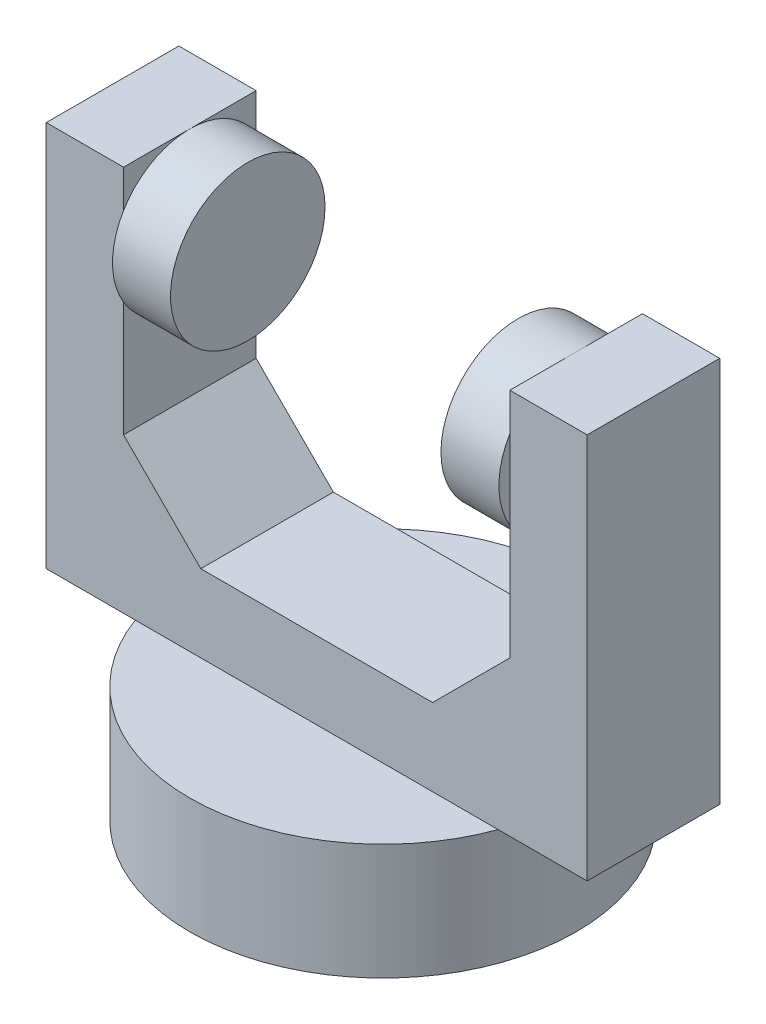
ISO-10303-21;
HEADER;
FILE_DESCRIPTION(('STEP AP214'),'2;1');
FILE_NAME('part.step','',(''),(''),'','','');
FILE_SCHEMA(('AUTOMOTIVE_DESIGN { 1 0 10303 214 1 1 1 1 }'));
ENDSEC;
DATA;
#1=APPLICATION_CONTEXT('core data for automotive mechanical design processes');
#2=APPLICATION_PROTOCOL_DEFINITION('international standard','automotive_design',2000,#1);
#3=PRODUCT_CONTEXT('',#1,'mechanical');
#4=PRODUCT('Part','Part','',(#3));
#5=PRODUCT_RELATED_PRODUCT_CATEGORY('part','',(#4));
#6=PRODUCT_DEFINITION_FORMATION('','',#4);
#7=PRODUCT_DEFINITION_CONTEXT('part definition',#1,'design');
#8=PRODUCT_DEFINITION('design','',#6,#7);
#9=PRODUCT_DEFINITION_SHAPE('','',#8);
#10=(LENGTH_UNIT() NAMED_UNIT(*) SI_UNIT(.MILLI.,.METRE.));
#11=(NAMED_UNIT(*) PLANE_ANGLE_UNIT() SI_UNIT($,.RADIAN.));
#12=(NAMED_UNIT(*) SI_UNIT($,.STERADIAN.) SOLID_ANGLE_UNIT());
#13=UNCERTAINTY_MEASURE_WITH_UNIT(LENGTH_MEASURE(1.E-05),#10,'distance_accuracy_value','');
#14=(GEOMETRIC_REPRESENTATION_CONTEXT(3) GLOBAL_UNCERTAINTY_ASSIGNED_CONTEXT((#13)) GLOBAL_UNIT_ASSIGNED_CONTEXT((#10,
#11,#12)) REPRESENTATION_CONTEXT('',''));
#15=CARTESIAN_POINT('',(0.,0.,0.));
#16=DIRECTION('',(0.,0.,1.));
#17=DIRECTION('',(1.,0.,0.));
#18=AXIS2_PLACEMENT_3D('',#15,#16,#17);
#19=CARTESIAN_POINT('',(12.5,12.5,-4.29038395748194));
#20=DIRECTION('',(1.,0.,0.));
#21=DIRECTION('',(0.,0.,-1.));
#22=AXIS2_PLACEMENT_3D('',#19,#20,#21);
#23=PLANE('',#22);
#24=DIRECTION('',(0.,1.,0.));
#25=VECTOR('',#24,1.);
#26=CARTESIAN_POINT('',(12.5,12.5,-4.29038395748194));
#27=LINE('',#26,#25);
#28=CARTESIAN_POINT('',(12.5,17.5,-4.29038395748194));
#29=VERTEX_POINT('',#28);
#30=CARTESIAN_POINT('',(12.5,24.9323930407125,-4.29038395748194));
#31=VERTEX_POINT('',#30);
#32=EDGE_CURVE('E162',#29,#31,#27,.T.);
#33=ORIENTED_EDGE('',*,*,#32,.F.);
#34=DIRECTION('',(0.,0.,1.));
#35=VECTOR('',#34,1.);
#36=CARTESIAN_POINT('',(12.5,17.5,-4.29038395748194));
#37=LINE('',#36,#35);
#38=CARTESIAN_POINT('',(12.5,17.5,4.29038395748193));
#39=VERTEX_POINT('',#38);
#40=EDGE_CURVE('E55',#29,#39,#37,.T.);
#41=ORIENTED_EDGE('',*,*,#40,.T.);
#42=DIRECTION('',(0.,1.,0.));
#43=VECTOR('',#42,1.);
#44=CARTESIAN_POINT('',(12.5,12.5,4.29038395748193));
#45=LINE('',#44,#43);
#46=CARTESIAN_POINT('',(12.5,24.9323930407125,4.29038395748193));
#47=VERTEX_POINT('',#46);
#48=EDGE_CURVE('E177',#39,#47,#45,.T.);
#49=ORIENTED_EDGE('',*,*,#48,.T.);
#50=CARTESIAN_POINT('',(12.5,27.5,0.));
#51=DIRECTION('',(1.,0.,0.));
#52=DIRECTION('',(0.,0.,-1.));
#53=AXIS2_PLACEMENT_3D('',#50,#51,#52);
#54=CIRCLE('',#53,5.);
#55=EDGE_CURVE('E190',#31,#47,#54,.F.);
#56=ORIENTED_EDGE('',*,*,#55,.F.);
#57=EDGE_LOOP('',(#33,#41,#49,#56));
#58=FACE_BOUND('',#57,.T.);
#59=ADVANCED_FACE('F39',(#58),#23,.F.);
#60=CARTESIAN_POINT('',(12.5,27.5,0.));
#61=DIRECTION('',(-1.,0.,0.));
#62=DIRECTION('',(0.,0.,1.));
#63=AXIS2_PLACEMENT_3D('',#60,#61,#62);
#64=CIRCLE('',#63,5.);
#65=CARTESIAN_POINT('',(12.5,30.0676069592875,4.29038395748193));
#66=VERTEX_POINT('',#65);
#67=CARTESIAN_POINT('',(12.5,32.5,0.));
#68=VERTEX_POINT('',#67);
#69=EDGE_CURVE('E183',#66,#68,#64,.T.);
#70=ORIENTED_EDGE('',*,*,#69,.F.);
#71=CARTESIAN_POINT('',(12.5,32.5,4.29038395748194));
#72=VERTEX_POINT('',#71);
#73=EDGE_CURVE('E261',#66,#72,#45,.T.);
#74=ORIENTED_EDGE('',*,*,#73,.T.);
#75=DIRECTION('',(0.,0.,-1.));
#76=VECTOR('',#75,1.);
#77=CARTESIAN_POINT('',(12.5,32.5,-4.29038395748194));
#78=LINE('',#77,#76);
#79=EDGE_CURVE('E240',#72,#68,#78,.T.);
#80=ORIENTED_EDGE('',*,*,#79,.T.);
#81=EDGE_LOOP('',(#70,#74,#80));
#82=FACE_BOUND('',#81,.T.);
#83=ADVANCED_FACE('F376',(#82),#23,.F.);
#84=CARTESIAN_POINT('',(-12.5,12.5,-4.29038395748194));
#85=DIRECTION('',(-1.,0.,0.));
#86=DIRECTION('',(0.,0.,1.));
#87=AXIS2_PLACEMENT_3D('',#84,#85,#86);
#88=PLANE('',#87);
#89=DIRECTION('',(0.,1.,0.));
#90=VECTOR('',#89,1.);
#91=CARTESIAN_POINT('',(-12.5,12.5,4.29038395748193));
#92=LINE('',#91,#90);
#93=CARTESIAN_POINT('',(-12.5,17.5,4.29038395748193));
#94=VERTEX_POINT('',#93);
#95=CARTESIAN_POINT('',(-12.5,24.9323930407125,4.29038395748193));
#96=VERTEX_POINT('',#95);
#97=EDGE_CURVE('E239',#94,#96,#92,.T.);
#98=ORIENTED_EDGE('',*,*,#97,.F.);
#99=DIRECTION('',(0.,0.,-1.));
#100=VECTOR('',#99,1.);
#101=CARTESIAN_POINT('',(-12.5,17.5,-4.29038395748194));
#102=LINE('',#101,#100);
#103=CARTESIAN_POINT('',(-12.5,17.5,-4.29038395748194));
#104=VERTEX_POINT('',#103);
#105=EDGE_CURVE('E204',#94,#104,#102,.T.);
#106=ORIENTED_EDGE('',*,*,#105,.T.);
#107=DIRECTION('',(0.,1.,0.));
#108=VECTOR('',#107,1.);
#109=CARTESIAN_POINT('',(-12.5,12.5,-4.29038395748194));
#110=LINE('',#109,#108);
#111=CARTESIAN_POINT('',(-12.5,24.9323930407125,-4.29038395748194));
#112=VERTEX_POINT('',#111);
#113=EDGE_CURVE('E252',#104,#112,#110,.T.);
#114=ORIENTED_EDGE('',*,*,#113,.T.);
#115=CARTESIAN_POINT('',(-12.5,27.5,0.));
#116=DIRECTION('',(-1.,0.,0.));
#117=DIRECTION('',(0.,0.,1.));
#118=AXIS2_PLACEMENT_3D('',#115,#116,#117);
#119=CIRCLE('',#118,5.);
#120=EDGE_CURVE('E191',#96,#112,#119,.F.);
#121=ORIENTED_EDGE('',*,*,#120,.F.);
#122=EDGE_LOOP('',(#98,#106,#114,#121));
#123=FACE_BOUND('',#122,.T.);
#124=ADVANCED_FACE('F381',(#123),#88,.F.);
#125=CARTESIAN_POINT('',(-12.5,27.5,0.));
#126=DIRECTION('',(1.,0.,0.));
#127=DIRECTION('',(0.,0.,-1.));
#128=AXIS2_PLACEMENT_3D('',#125,#126,#127);
#129=CIRCLE('',#128,5.);
#130=CARTESIAN_POINT('',(-12.5,30.0676069592875,-4.29038395748194));
#131=VERTEX_POINT('',#130);
#132=CARTESIAN_POINT('',(-12.5,32.5,0.));
#133=VERTEX_POINT('',#132);
#134=EDGE_CURVE('E409',#131,#133,#129,.T.);
#135=ORIENTED_EDGE('',*,*,#134,.F.);
#136=CARTESIAN_POINT('',(-12.5,32.5,-4.29038395748194));
#137=VERTEX_POINT('',#136);
#138=EDGE_CURVE('E256',#131,#137,#110,.T.);
#139=ORIENTED_EDGE('',*,*,#138,.T.);
#140=DIRECTION('',(0.,0.,1.));
#141=VECTOR('',#140,1.);
#142=CARTESIAN_POINT('',(-12.5,32.5,-4.29038395748194));
#143=LINE('',#142,#141);
#144=EDGE_CURVE('E244',#137,#133,#143,.T.);
#145=ORIENTED_EDGE('',*,*,#144,.T.);
#146=EDGE_LOOP('',(#135,#139,#145));
#147=FACE_BOUND('',#146,.T.);
#148=ADVANCED_FACE('F394',(#147),#88,.F.);
#149=CARTESIAN_POINT('',(0.,32.5,0.));
#150=DIRECTION('',(0.,1.,0.));
#151=DIRECTION('',(0.,0.,1.));
#152=AXIS2_PLACEMENT_3D('',#149,#150,#151);
#153=PLANE('',#152);
#154=ORIENTED_EDGE('',*,*,#144,.F.);
#155=DIRECTION('',(-1.,0.,0.));
#156=VECTOR('',#155,1.);
#157=CARTESIAN_POINT('',(-17.5,32.5,-4.29038395748194));
#158=LINE('',#157,#156);
#159=CARTESIAN_POINT('',(-17.5,32.5,-4.29038395748194));
#160=VERTEX_POINT('',#159);
#161=EDGE_CURVE('E277',#137,#160,#158,.T.);
#162=ORIENTED_EDGE('',*,*,#161,.T.);
#163=DIRECTION('',(0.,0.,1.));
#164=VECTOR('',#163,1.);
#165=CARTESIAN_POINT('',(-17.5,32.5,-4.29038395748194));
#166=LINE('',#165,#164);
#167=CARTESIAN_POINT('',(-17.5,32.5,4.29038395748193));
#168=VERTEX_POINT('',#167);
#169=EDGE_CURVE('E264',#160,#168,#166,.T.);
#170=ORIENTED_EDGE('',*,*,#169,.T.);
#171=DIRECTION('',(1.,0.,0.));
#172=VECTOR('',#171,1.);
#173=CARTESIAN_POINT('',(-17.5,32.5,4.29038395748193));
#174=LINE('',#173,#172);
#175=CARTESIAN_POINT('',(-12.5,32.5,4.29038395748193));
#176=VERTEX_POINT('',#175);
#177=EDGE_CURVE('E270',#168,#176,#174,.T.);
#178=ORIENTED_EDGE('',*,*,#177,.T.);
#179=EDGE_CURVE('E248',#133,#176,#143,.T.);
#180=ORIENTED_EDGE('',*,*,#179,.F.);
#181=EDGE_LOOP('',(#154,#162,#170,#178,#180));
#182=FACE_BOUND('',#181,.T.);
#183=ADVANCED_FACE('F373',(#182),#153,.T.);
#184=CARTESIAN_POINT('',(0.,7.5,0.));
#185=DIRECTION('',(0.,1.,0.));
#186=DIRECTION('',(0.,0.,1.));
#187=AXIS2_PLACEMENT_3D('',#184,#185,#186);
#188=PLANE('',#187);
#189=DIRECTION('',(-1.,0.,0.));
#190=VECTOR('',#189,1.);
#191=CARTESIAN_POINT('',(-17.5,7.5,-4.29038395748194));
#192=LINE('',#191,#190);
#193=CARTESIAN_POINT('',(11.7406390583044,7.5,-4.29038395748194));
#194=VERTEX_POINT('',#193);
#195=CARTESIAN_POINT('',(-11.7406390583044,7.5,-4.29038395748194));
#196=VERTEX_POINT('',#195);
#197=EDGE_CURVE('E298',#194,#196,#192,.T.);
#198=ORIENTED_EDGE('',*,*,#197,.F.);
#199=CARTESIAN_POINT('',(0.,7.5,0.));
#200=DIRECTION('',(0.,1.,0.));
#201=DIRECTION('',(0.,0.,1.));
#202=AXIS2_PLACEMENT_3D('',#199,#200,#201);
#203=CIRCLE('',#202,12.5);
#204=EDGE_CURVE('E318',#194,#196,#203,.T.);
#205=ORIENTED_EDGE('',*,*,#204,.T.);
#206=EDGE_LOOP('',(#198,#205));
#207=FACE_BOUND('',#206,.T.);
#208=ADVANCED_FACE('F338',(#207),#188,.T.);
#209=CARTESIAN_POINT('',(0.,7.5,0.));
#210=DIRECTION('',(0.,-1.,0.));
#211=DIRECTION('',(0.,0.,-1.));
#212=AXIS2_PLACEMENT_3D('',#209,#210,#211);
#213=CYLINDRICAL_SURFACE('',#212,12.5);
#214=CARTESIAN_POINT('',(11.7406390583043,7.5,4.29038395748194));
#215=VERTEX_POINT('',#214);
#216=EDGE_CURVE('E315',#215,#194,#203,.T.);
#217=ORIENTED_EDGE('',*,*,#216,.F.);
#218=CARTESIAN_POINT('',(-11.7406390583044,7.5,4.29038395748193));
#219=VERTEX_POINT('',#218);
#220=EDGE_CURVE('E319',#219,#215,#203,.T.);
#221=ORIENTED_EDGE('',*,*,#220,.F.);
#222=EDGE_CURVE('E326',#196,#219,#203,.T.);
#223=ORIENTED_EDGE('',*,*,#222,.F.);
#224=ORIENTED_EDGE('',*,*,#204,.F.);
#225=EDGE_LOOP('',(#217,#221,#223,#224));
#226=FACE_BOUND('',#225,.T.);
#227=CARTESIAN_POINT('',(0.,0.,0.));
#228=DIRECTION('',(0.,1.,0.));
#229=DIRECTION('',(0.,0.,1.));
#230=AXIS2_PLACEMENT_3D('',#227,#228,#229);
#231=CIRCLE('',#230,12.5);
#232=CARTESIAN_POINT('',(0.,0.,12.5));
#233=VERTEX_POINT('',#232);
#234=EDGE_CURVE('E314',#233,#233,#231,.T.);
#235=ORIENTED_EDGE('',*,*,#234,.T.);
#236=EDGE_LOOP('',(#235));
#237=FACE_BOUND('',#236,.T.);
#238=ADVANCED_FACE('F363',(#226,#237),#213,.T.);
#239=DIRECTION('',(1.,0.,0.));
#240=VECTOR('',#239,1.);
#241=CARTESIAN_POINT('',(-17.5,7.5,4.29038395748193));
#242=LINE('',#241,#240);
#243=EDGE_CURVE('E291',#219,#215,#242,.T.);
#244=ORIENTED_EDGE('',*,*,#243,.F.);
#245=ORIENTED_EDGE('',*,*,#220,.T.);
#246=EDGE_LOOP('',(#244,#245));
#247=FACE_BOUND('',#246,.T.);
#248=ADVANCED_FACE('F365',(#247),#188,.T.);
#249=CARTESIAN_POINT('',(0.,0.,0.));
#250=DIRECTION('',(0.,1.,0.));
#251=DIRECTION('',(0.,0.,1.));
#252=AXIS2_PLACEMENT_3D('',#249,#250,#251);
#253=PLANE('',#252);
#254=ORIENTED_EDGE('',*,*,#234,.F.);
#255=EDGE_LOOP('',(#254));
#256=FACE_BOUND('',#255,.T.);
#257=ADVANCED_FACE('F371',(#256),#253,.F.);
#258=CARTESIAN_POINT('',(0.,7.5,0.));
#259=DIRECTION('',(0.,1.,0.));
#260=DIRECTION('',(0.,0.,1.));
#261=AXIS2_PLACEMENT_3D('',#258,#259,#260);
#262=PLANE('',#261);
#263=CARTESIAN_POINT('',(17.5,7.5,4.29038395748194));
#264=VERTEX_POINT('',#263);
#265=EDGE_CURVE('E285',#215,#264,#242,.T.);
#266=ORIENTED_EDGE('',*,*,#265,.F.);
#267=ORIENTED_EDGE('',*,*,#216,.T.);
#268=CARTESIAN_POINT('',(17.5,7.5,-4.29038395748194));
#269=VERTEX_POINT('',#268);
#270=EDGE_CURVE('E269',#269,#194,#192,.T.);
#271=ORIENTED_EDGE('',*,*,#270,.F.);
#272=DIRECTION('',(0.,0.,-1.));
#273=VECTOR('',#272,1.);
#274=CARTESIAN_POINT('',(17.5,7.5,-4.29038395748194));
#275=LINE('',#274,#273);
#276=EDGE_CURVE('E290',#264,#269,#275,.T.);
#277=ORIENTED_EDGE('',*,*,#276,.F.);
#278=EDGE_LOOP('',(#266,#267,#271,#277));
#279=FACE_BOUND('',#278,.T.);
#280=ADVANCED_FACE('F362',(#279),#262,.F.);
#281=CARTESIAN_POINT('',(-17.5,7.5,-4.29038395748194));
#282=VERTEX_POINT('',#281);
#283=EDGE_CURVE('E294',#196,#282,#192,.T.);
#284=ORIENTED_EDGE('',*,*,#283,.F.);
#285=ORIENTED_EDGE('',*,*,#222,.T.);
#286=CARTESIAN_POINT('',(-17.5,7.5,4.29038395748193));
#287=VERTEX_POINT('',#286);
#288=EDGE_CURVE('E286',#287,#219,#242,.T.);
#289=ORIENTED_EDGE('',*,*,#288,.F.);
#290=DIRECTION('',(0.,0.,1.));
#291=VECTOR('',#290,1.);
#292=CARTESIAN_POINT('',(-17.5,7.5,-4.29038395748194));
#293=LINE('',#292,#291);
#294=EDGE_CURVE('E254',#282,#287,#293,.T.);
#295=ORIENTED_EDGE('',*,*,#294,.F.);
#296=EDGE_LOOP('',(#284,#285,#289,#295));
#297=FACE_BOUND('',#296,.T.);
#298=ADVANCED_FACE('F342',(#297),#262,.F.);
#299=CARTESIAN_POINT('',(-17.5,32.5,-4.29038395748194));
#300=DIRECTION('',(1.,0.,0.));
#301=DIRECTION('',(0.,0.,-1.));
#302=AXIS2_PLACEMENT_3D('',#299,#300,#301);
#303=PLANE('',#302);
#304=ORIENTED_EDGE('',*,*,#294,.T.);
#305=DIRECTION('',(0.,-1.,0.));
#306=VECTOR('',#305,1.);
#307=CARTESIAN_POINT('',(-17.5,32.5,4.29038395748193));
#308=LINE('',#307,#306);
#309=EDGE_CURVE('E310',#168,#287,#308,.T.);
#310=ORIENTED_EDGE('',*,*,#309,.F.);
#311=ORIENTED_EDGE('',*,*,#169,.F.);
#312=DIRECTION('',(0.,-1.,0.));
#313=VECTOR('',#312,1.);
#314=CARTESIAN_POINT('',(-17.5,32.5,-4.29038395748194));
#315=LINE('',#314,#313);
#316=EDGE_CURVE('E281',#160,#282,#315,.T.);
#317=ORIENTED_EDGE('',*,*,#316,.T.);
#318=EDGE_LOOP('',(#304,#310,#311,#317));
#319=FACE_BOUND('',#318,.T.);
#320=ADVANCED_FACE('F454',(#319),#303,.F.);
#321=CARTESIAN_POINT('',(-17.5,32.5,4.29038395748193));
#322=DIRECTION('',(0.,0.,-1.));
#323=DIRECTION('',(-1.,0.,0.));
#324=AXIS2_PLACEMENT_3D('',#321,#322,#323);
#325=PLANE('',#324);
#326=DIRECTION('',(1.,0.,0.));
#327=VECTOR('',#326,1.);
#328=CARTESIAN_POINT('',(-12.5,12.5,4.29038395748193));
#329=LINE('',#328,#327);
#330=CARTESIAN_POINT('',(-7.49999999999997,12.5,4.29038395748193));
#331=VERTEX_POINT('',#330);
#332=CARTESIAN_POINT('',(7.49999999999997,12.5,4.29038395748193));
#333=VERTEX_POINT('',#332);
#334=EDGE_CURVE('E226',#331,#333,#329,.T.);
#335=ORIENTED_EDGE('',*,*,#334,.F.);
#336=DIRECTION('',(-0.707106781186551,0.707106781186544,0.));
#337=VECTOR('',#336,1.);
#338=CARTESIAN_POINT('',(-22.5,27.4999999999999,4.29038395748193));
#339=LINE('',#338,#337);
#340=EDGE_CURVE('E207',#331,#94,#339,.T.);
#341=ORIENTED_EDGE('',*,*,#340,.T.);
#342=ORIENTED_EDGE('',*,*,#97,.T.);
#343=CARTESIAN_POINT('',(-12.5,30.0676069592875,4.29038395748193));
#344=VERTEX_POINT('',#343);
#345=EDGE_CURVE('E237',#96,#344,#92,.T.);
#346=ORIENTED_EDGE('',*,*,#345,.T.);
#347=EDGE_CURVE('E233',#344,#176,#92,.T.);
#348=ORIENTED_EDGE('',*,*,#347,.T.);
#349=ORIENTED_EDGE('',*,*,#177,.F.);
#350=ORIENTED_EDGE('',*,*,#309,.T.);
#351=ORIENTED_EDGE('',*,*,#288,.T.);
#352=ORIENTED_EDGE('',*,*,#243,.T.);
#353=ORIENTED_EDGE('',*,*,#265,.T.);
#354=DIRECTION('',(0.,-1.,0.));
#355=VECTOR('',#354,1.);
#356=CARTESIAN_POINT('',(17.5,32.5,4.29038395748194));
#357=LINE('',#356,#355);
#358=CARTESIAN_POINT('',(17.5,32.5,4.29038395748194));
#359=VERTEX_POINT('',#358);
#360=EDGE_CURVE('E306',#359,#264,#357,.T.);
#361=ORIENTED_EDGE('',*,*,#360,.F.);
#362=EDGE_CURVE('E268',#72,#359,#174,.T.);
#363=ORIENTED_EDGE('',*,*,#362,.F.);
#364=ORIENTED_EDGE('',*,*,#73,.F.);
#365=EDGE_CURVE('E260',#47,#66,#45,.T.);
#366=ORIENTED_EDGE('',*,*,#365,.F.);
#367=ORIENTED_EDGE('',*,*,#48,.F.);
#368=DIRECTION('',(-0.707106781186551,-0.707106781186544,0.));
#369=VECTOR('',#368,1.);
#370=CARTESIAN_POINT('',(4.99999999999987,9.99999999999991,4.29038395748193));
#371=LINE('',#370,#369);
#372=EDGE_CURVE('E11',#39,#333,#371,.T.);
#373=ORIENTED_EDGE('',*,*,#372,.T.);
#374=EDGE_LOOP('',(#335,#341,#342,#346,#348,#349,#350,#351,#352,#353,#361,#363,#364,#366,#367,#373));
#375=FACE_BOUND('',#374,.T.);
#376=ADVANCED_FACE('F354',(#375),#325,.F.);
#377=CARTESIAN_POINT('',(17.5,32.5,-4.29038395748194));
#378=DIRECTION('',(-1.,0.,0.));
#379=DIRECTION('',(0.,0.,1.));
#380=AXIS2_PLACEMENT_3D('',#377,#378,#379);
#381=PLANE('',#380);
#382=ORIENTED_EDGE('',*,*,#276,.T.);
#383=DIRECTION('',(0.,-1.,0.));
#384=VECTOR('',#383,1.);
#385=CARTESIAN_POINT('',(17.5,32.5,-4.29038395748194));
#386=LINE('',#385,#384);
#387=CARTESIAN_POINT('',(17.5,32.5,-4.29038395748194));
#388=VERTEX_POINT('',#387);
#389=EDGE_CURVE('E302',#388,#269,#386,.T.);
#390=ORIENTED_EDGE('',*,*,#389,.F.);
#391=DIRECTION('',(0.,0.,-1.));
#392=VECTOR('',#391,1.);
#393=CARTESIAN_POINT('',(17.5,32.5,-4.29038395748194));
#394=LINE('',#393,#392);
#395=EDGE_CURVE('E274',#359,#388,#394,.T.);
#396=ORIENTED_EDGE('',*,*,#395,.F.);
#397=ORIENTED_EDGE('',*,*,#360,.T.);
#398=EDGE_LOOP('',(#382,#390,#396,#397));
#399=FACE_BOUND('',#398,.T.);
#400=ADVANCED_FACE('F360',(#399),#381,.F.);
#401=CARTESIAN_POINT('',(-17.5,32.5,-4.29038395748194));
#402=DIRECTION('',(0.,0.,1.));
#403=DIRECTION('',(1.,0.,0.));
#404=AXIS2_PLACEMENT_3D('',#401,#402,#403);
#405=PLANE('',#404);
#406=ORIENTED_EDGE('',*,*,#161,.F.);
#407=ORIENTED_EDGE('',*,*,#138,.F.);
#408=EDGE_CURVE('E255',#112,#131,#110,.T.);
#409=ORIENTED_EDGE('',*,*,#408,.F.);
#410=ORIENTED_EDGE('',*,*,#113,.F.);
#411=DIRECTION('',(0.707106781186551,-0.707106781186544,0.));
#412=VECTOR('',#411,1.);
#413=CARTESIAN_POINT('',(-22.5,27.4999999999999,-4.29038395748194));
#414=LINE('',#413,#412);
#415=CARTESIAN_POINT('',(-7.49999999999997,12.5,-4.29038395748194));
#416=VERTEX_POINT('',#415);
#417=EDGE_CURVE('E210',#104,#416,#414,.T.);
#418=ORIENTED_EDGE('',*,*,#417,.T.);
#419=DIRECTION('',(-1.,0.,0.));
#420=VECTOR('',#419,1.);
#421=CARTESIAN_POINT('',(-12.5,12.5,-4.29038395748194));
#422=LINE('',#421,#420);
#423=CARTESIAN_POINT('',(7.49999999999996,12.5,-4.29038395748194));
#424=VERTEX_POINT('',#423);
#425=EDGE_CURVE('E224',#424,#416,#422,.T.);
#426=ORIENTED_EDGE('',*,*,#425,.F.);
#427=DIRECTION('',(0.707106781186551,0.707106781186544,0.));
#428=VECTOR('',#427,1.);
#429=CARTESIAN_POINT('',(4.99999999999987,9.99999999999991,-4.29038395748194));
#430=LINE('',#429,#428);
#431=EDGE_CURVE('E48',#424,#29,#430,.T.);
#432=ORIENTED_EDGE('',*,*,#431,.T.);
#433=ORIENTED_EDGE('',*,*,#32,.T.);
#434=CARTESIAN_POINT('',(12.5,30.0676069592875,-4.29038395748193));
#435=VERTEX_POINT('',#434);
#436=EDGE_CURVE('E155',#31,#435,#27,.T.);
#437=ORIENTED_EDGE('',*,*,#436,.T.);
#438=CARTESIAN_POINT('',(12.5,32.5,-4.29038395748194));
#439=VERTEX_POINT('',#438);
#440=EDGE_CURVE('E160',#435,#439,#27,.T.);
#441=ORIENTED_EDGE('',*,*,#440,.T.);
#442=EDGE_CURVE('E278',#388,#439,#158,.T.);
#443=ORIENTED_EDGE('',*,*,#442,.F.);
#444=ORIENTED_EDGE('',*,*,#389,.T.);
#445=ORIENTED_EDGE('',*,*,#270,.T.);
#446=ORIENTED_EDGE('',*,*,#197,.T.);
#447=ORIENTED_EDGE('',*,*,#283,.T.);
#448=ORIENTED_EDGE('',*,*,#316,.F.);
#449=EDGE_LOOP('',(#406,#407,#409,#410,#418,#426,#432,#433,#437,#441,#443,#444,#445,#446,#447,#448));
#450=FACE_BOUND('',#449,.T.);
#451=ADVANCED_FACE('F158',(#450),#405,.F.);
#452=ORIENTED_EDGE('',*,*,#79,.F.);
#453=ORIENTED_EDGE('',*,*,#362,.T.);
#454=ORIENTED_EDGE('',*,*,#395,.T.);
#455=ORIENTED_EDGE('',*,*,#442,.T.);
#456=EDGE_CURVE('E174',#68,#439,#78,.T.);
#457=ORIENTED_EDGE('',*,*,#456,.F.);
#458=EDGE_LOOP('',(#452,#453,#454,#455,#457));
#459=FACE_BOUND('',#458,.T.);
#460=ADVANCED_FACE('F392',(#459),#153,.T.);
#461=EDGE_CURVE('E197',#133,#344,#119,.F.);
#462=ORIENTED_EDGE('',*,*,#461,.F.);
#463=ORIENTED_EDGE('',*,*,#179,.T.);
#464=ORIENTED_EDGE('',*,*,#347,.F.);
#465=EDGE_LOOP('',(#462,#463,#464));
#466=FACE_BOUND('',#465,.T.);
#467=ADVANCED_FACE('F386',(#466),#88,.F.);
#468=EDGE_CURVE('E172',#68,#435,#54,.F.);
#469=ORIENTED_EDGE('',*,*,#468,.F.);
#470=ORIENTED_EDGE('',*,*,#456,.T.);
#471=ORIENTED_EDGE('',*,*,#440,.F.);
#472=EDGE_LOOP('',(#469,#470,#471));
#473=FACE_BOUND('',#472,.T.);
#474=ADVANCED_FACE('F170',(#473),#23,.F.);
#475=CARTESIAN_POINT('',(0.,12.5,0.));
#476=DIRECTION('',(0.,1.,0.));
#477=DIRECTION('',(0.,0.,1.));
#478=AXIS2_PLACEMENT_3D('',#475,#476,#477);
#479=PLANE('',#478);
#480=ORIENTED_EDGE('',*,*,#334,.T.);
#481=DIRECTION('',(0.,0.,-1.));
#482=VECTOR('',#481,1.);
#483=CARTESIAN_POINT('',(7.49999999999997,12.5,0.));
#484=LINE('',#483,#482);
#485=EDGE_CURVE('E214',#333,#424,#484,.T.);
#486=ORIENTED_EDGE('',*,*,#485,.T.);
#487=ORIENTED_EDGE('',*,*,#425,.T.);
#488=DIRECTION('',(0.,0.,1.));
#489=VECTOR('',#488,1.);
#490=CARTESIAN_POINT('',(-7.49999999999997,12.5,0.));
#491=LINE('',#490,#489);
#492=EDGE_CURVE('E195',#416,#331,#491,.T.);
#493=ORIENTED_EDGE('',*,*,#492,.T.);
#494=EDGE_LOOP('',(#480,#486,#487,#493));
#495=FACE_BOUND('',#494,.T.);
#496=ADVANCED_FACE('F223',(#495),#479,.T.);
#497=CARTESIAN_POINT('',(-12.5,27.5,0.));
#498=DIRECTION('',(1.,0.,0.));
#499=DIRECTION('',(0.,0.,-1.));
#500=AXIS2_PLACEMENT_3D('',#497,#498,#499);
#501=PLANE('',#500);
#502=EDGE_CURVE('E416',#344,#96,#129,.T.);
#503=ORIENTED_EDGE('',*,*,#502,.F.);
#504=ORIENTED_EDGE('',*,*,#345,.F.);
#505=EDGE_LOOP('',(#503,#504));
#506=FACE_BOUND('',#505,.T.);
#507=ADVANCED_FACE('F391',(#506),#501,.F.);
#508=EDGE_CURVE('E417',#112,#131,#129,.T.);
#509=ORIENTED_EDGE('',*,*,#508,.F.);
#510=ORIENTED_EDGE('',*,*,#408,.T.);
#511=EDGE_LOOP('',(#509,#510));
#512=FACE_BOUND('',#511,.T.);
#513=ADVANCED_FACE('F423',(#512),#501,.F.);
#514=CARTESIAN_POINT('',(-8.75,27.5,0.));
#515=DIRECTION('',(-1.,0.,0.));
#516=DIRECTION('',(0.,0.,1.));
#517=AXIS2_PLACEMENT_3D('',#514,#515,#516);
#518=CYLINDRICAL_SURFACE('',#517,5.);
#519=CARTESIAN_POINT('',(-8.75,27.5,0.));
#520=DIRECTION('',(1.,0.,0.));
#521=DIRECTION('',(0.,0.,-1.));
#522=AXIS2_PLACEMENT_3D('',#519,#520,#521);
#523=CIRCLE('',#522,5.);
#524=CARTESIAN_POINT('',(-8.75,27.5,-5.));
#525=VERTEX_POINT('',#524);
#526=EDGE_CURVE('E415',#525,#525,#523,.T.);
#527=ORIENTED_EDGE('',*,*,#526,.F.);
#528=EDGE_LOOP('',(#527));
#529=FACE_BOUND('',#528,.T.);
#530=ORIENTED_EDGE('',*,*,#134,.T.);
#531=ORIENTED_EDGE('',*,*,#461,.T.);
#532=ORIENTED_EDGE('',*,*,#502,.T.);
#533=ORIENTED_EDGE('',*,*,#120,.T.);
#534=ORIENTED_EDGE('',*,*,#508,.T.);
#535=EDGE_LOOP('',(#530,#531,#532,#533,#534));
#536=FACE_BOUND('',#535,.T.);
#537=ADVANCED_FACE('F425',(#529,#536),#518,.T.);
#538=CARTESIAN_POINT('',(-8.75,27.5,0.));
#539=DIRECTION('',(1.,0.,0.));
#540=DIRECTION('',(0.,0.,-1.));
#541=AXIS2_PLACEMENT_3D('',#538,#539,#540);
#542=PLANE('',#541);
#543=ORIENTED_EDGE('',*,*,#526,.T.);
#544=EDGE_LOOP('',(#543));
#545=FACE_BOUND('',#544,.T.);
#546=ADVANCED_FACE('F484',(#545),#542,.T.);
#547=CARTESIAN_POINT('',(12.5,27.5,0.));
#548=DIRECTION('',(-1.,0.,0.));
#549=DIRECTION('',(0.,0.,1.));
#550=AXIS2_PLACEMENT_3D('',#547,#548,#549);
#551=PLANE('',#550);
#552=EDGE_CURVE('E184',#47,#66,#64,.T.);
#553=ORIENTED_EDGE('',*,*,#552,.F.);
#554=ORIENTED_EDGE('',*,*,#365,.T.);
#555=EDGE_LOOP('',(#553,#554));
#556=FACE_BOUND('',#555,.T.);
#557=ADVANCED_FACE('F442',(#556),#551,.F.);
#558=EDGE_CURVE('E178',#435,#31,#64,.T.);
#559=ORIENTED_EDGE('',*,*,#558,.F.);
#560=ORIENTED_EDGE('',*,*,#436,.F.);
#561=EDGE_LOOP('',(#559,#560));
#562=FACE_BOUND('',#561,.T.);
#563=ADVANCED_FACE('F179',(#562),#551,.F.);
#564=CARTESIAN_POINT('',(8.75,27.5,0.));
#565=DIRECTION('',(1.,0.,0.));
#566=DIRECTION('',(0.,0.,-1.));
#567=AXIS2_PLACEMENT_3D('',#564,#565,#566);
#568=CYLINDRICAL_SURFACE('',#567,5.);
#569=CARTESIAN_POINT('',(8.75,27.5,0.));
#570=DIRECTION('',(-1.,0.,0.));
#571=DIRECTION('',(0.,0.,1.));
#572=AXIS2_PLACEMENT_3D('',#569,#570,#571);
#573=CIRCLE('',#572,5.);
#574=CARTESIAN_POINT('',(8.75,27.5,5.));
#575=VERTEX_POINT('',#574);
#576=EDGE_CURVE('E429',#575,#575,#573,.T.);
#577=ORIENTED_EDGE('',*,*,#576,.F.);
#578=EDGE_LOOP('',(#577));
#579=FACE_BOUND('',#578,.T.);
#580=ORIENTED_EDGE('',*,*,#69,.T.);
#581=ORIENTED_EDGE('',*,*,#468,.T.);
#582=ORIENTED_EDGE('',*,*,#558,.T.);
#583=ORIENTED_EDGE('',*,*,#55,.T.);
#584=ORIENTED_EDGE('',*,*,#552,.T.);
#585=EDGE_LOOP('',(#580,#581,#582,#583,#584));
#586=FACE_BOUND('',#585,.T.);
#587=ADVANCED_FACE('F187',(#579,#586),#568,.T.);
#588=CARTESIAN_POINT('',(8.75,27.5,0.));
#589=DIRECTION('',(-1.,0.,0.));
#590=DIRECTION('',(0.,0.,1.));
#591=AXIS2_PLACEMENT_3D('',#588,#589,#590);
#592=PLANE('',#591);
#593=ORIENTED_EDGE('',*,*,#576,.T.);
#594=EDGE_LOOP('',(#593));
#595=FACE_BOUND('',#594,.T.);
#596=ADVANCED_FACE('F471',(#595),#592,.T.);
#597=CARTESIAN_POINT('',(-7.49999999999997,12.5,0.));
#598=DIRECTION('',(-0.707106781186544,-0.707106781186551,0.));
#599=DIRECTION('',(0.,0.,1.));
#600=AXIS2_PLACEMENT_3D('',#597,#598,#599);
#601=PLANE('',#600);
#602=ORIENTED_EDGE('',*,*,#417,.F.);
#603=ORIENTED_EDGE('',*,*,#105,.F.);
#604=ORIENTED_EDGE('',*,*,#340,.F.);
#605=ORIENTED_EDGE('',*,*,#492,.F.);
#606=EDGE_LOOP('',(#602,#603,#604,#605));
#607=FACE_BOUND('',#606,.T.);
#608=ADVANCED_FACE('F466',(#607),#601,.F.);
#609=CARTESIAN_POINT('',(7.49999999999997,12.5,0.));
#610=DIRECTION('',(0.707106781186544,-0.707106781186551,0.));
#611=DIRECTION('',(0.,0.,-1.));
#612=AXIS2_PLACEMENT_3D('',#609,#610,#611);
#613=PLANE('',#612);
#614=ORIENTED_EDGE('',*,*,#372,.F.);
#615=ORIENTED_EDGE('',*,*,#40,.F.);
#616=ORIENTED_EDGE('',*,*,#431,.F.);
#617=ORIENTED_EDGE('',*,*,#485,.F.);
#618=EDGE_LOOP('',(#614,#615,#616,#617));
#619=FACE_BOUND('',#618,.T.);
#620=ADVANCED_FACE('F41',(#619),#613,.F.);
#621=CLOSED_SHELL('',(#59,#83,#124,#148,#183,#208,#238,#248,#257,#280,#298,#320,#376,#400,#451,
#460,#467,#474,#496,#507,#513,#537,#546,#557,#563,#587,#596,#608,#620));
#622=MANIFOLD_SOLID_BREP('B2',#621);
#623=ADVANCED_BREP_SHAPE_REPRESENTATION('',(#18,#622),#14);
#624=SHAPE_DEFINITION_REPRESENTATION(#9,#623);
ENDSEC;
END-ISO-10303-21;
